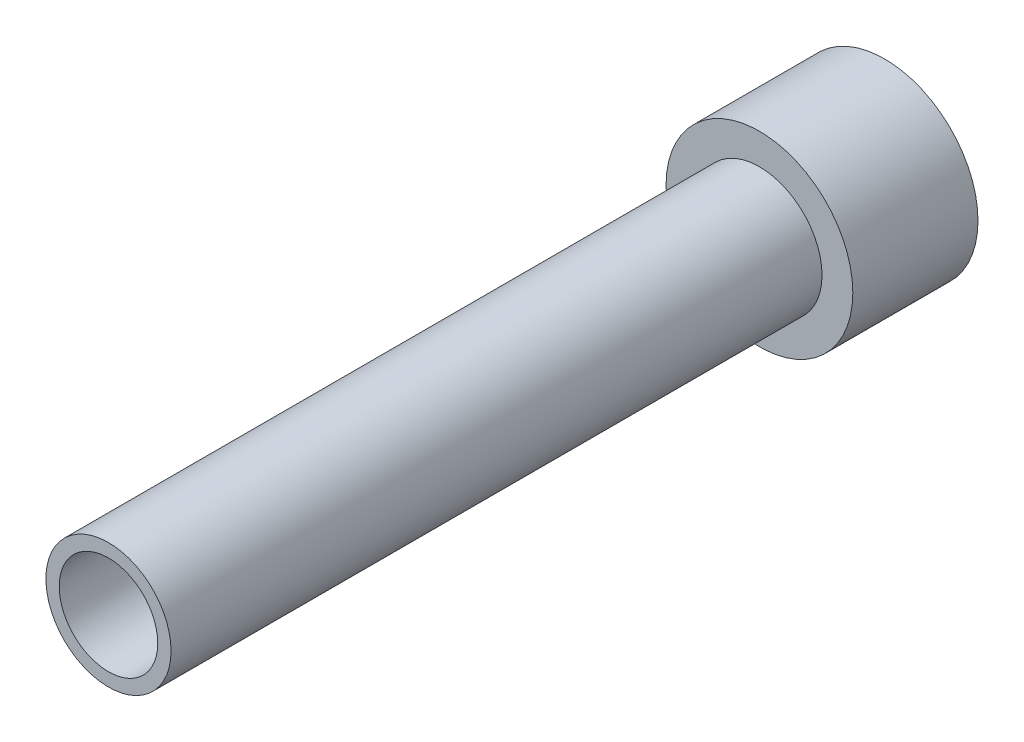
ISO-10303-21;
HEADER;
FILE_DESCRIPTION(('STEP AP214'),'2;1');
FILE_NAME('part.step','',(''),(''),'','','');
FILE_SCHEMA(('AUTOMOTIVE_DESIGN { 1 0 10303 214 1 1 1 1 }'));
ENDSEC;
DATA;
#1=APPLICATION_CONTEXT('core data for automotive mechanical design processes');
#2=APPLICATION_PROTOCOL_DEFINITION('international standard','automotive_design',2000,#1);
#3=PRODUCT_CONTEXT('',#1,'mechanical');
#4=PRODUCT('Part','Part','',(#3));
#5=PRODUCT_RELATED_PRODUCT_CATEGORY('part','',(#4));
#6=PRODUCT_DEFINITION_FORMATION('','',#4);
#7=PRODUCT_DEFINITION_CONTEXT('part definition',#1,'design');
#8=PRODUCT_DEFINITION('design','',#6,#7);
#9=PRODUCT_DEFINITION_SHAPE('','',#8);
#10=(LENGTH_UNIT() NAMED_UNIT(*) SI_UNIT(.MILLI.,.METRE.));
#11=(NAMED_UNIT(*) PLANE_ANGLE_UNIT() SI_UNIT($,.RADIAN.));
#12=(NAMED_UNIT(*) SI_UNIT($,.STERADIAN.) SOLID_ANGLE_UNIT());
#13=UNCERTAINTY_MEASURE_WITH_UNIT(LENGTH_MEASURE(1.E-05),#10,'distance_accuracy_value','');
#14=(GEOMETRIC_REPRESENTATION_CONTEXT(3) GLOBAL_UNCERTAINTY_ASSIGNED_CONTEXT((#13)) GLOBAL_UNIT_ASSIGNED_CONTEXT((#10,
#11,#12)) REPRESENTATION_CONTEXT('',''));
#15=CARTESIAN_POINT('',(0.,0.,0.));
#16=DIRECTION('',(0.,0.,1.));
#17=DIRECTION('',(1.,0.,0.));
#18=AXIS2_PLACEMENT_3D('',#15,#16,#17);
#19=CARTESIAN_POINT('',(0.,0.,6.35));
#20=DIRECTION('',(0.,0.,1.));
#21=DIRECTION('',(1.,0.,0.));
#22=AXIS2_PLACEMENT_3D('',#19,#20,#21);
#23=PLANE('',#22);
#24=CARTESIAN_POINT('',(0.,0.,6.35));
#25=DIRECTION('',(0.,0.,1.));
#26=DIRECTION('',(1.,0.,0.));
#27=AXIS2_PLACEMENT_3D('',#24,#25,#26);
#28=CIRCLE('',#27,4.7371);
#29=CARTESIAN_POINT('',(4.7371,0.,6.35));
#30=VERTEX_POINT('',#29);
#31=EDGE_CURVE('E56',#30,#30,#28,.T.);
#32=ORIENTED_EDGE('',*,*,#31,.T.);
#33=EDGE_LOOP('',(#32));
#34=FACE_BOUND('',#33,.T.);
#35=CARTESIAN_POINT('',(0.,0.,6.35));
#36=DIRECTION('',(0.,0.,1.));
#37=DIRECTION('',(1.,0.,0.));
#38=AXIS2_PLACEMENT_3D('',#35,#36,#37);
#39=CIRCLE('',#38,3.175);
#40=CARTESIAN_POINT('',(3.175,0.,6.35));
#41=VERTEX_POINT('',#40);
#42=EDGE_CURVE('E77',#41,#41,#39,.T.);
#43=ORIENTED_EDGE('',*,*,#42,.F.);
#44=EDGE_LOOP('',(#43));
#45=FACE_BOUND('',#44,.T.);
#46=ADVANCED_FACE('F43',(#34,#45),#23,.T.);
#47=CARTESIAN_POINT('',(0.,0.,0.));
#48=DIRECTION('',(0.,0.,1.));
#49=DIRECTION('',(1.,0.,0.));
#50=AXIS2_PLACEMENT_3D('',#47,#48,#49);
#51=PLANE('',#50);
#52=CARTESIAN_POINT('',(0.,0.,0.));
#53=DIRECTION('',(0.,0.,1.));
#54=DIRECTION('',(1.,0.,0.));
#55=AXIS2_PLACEMENT_3D('',#52,#53,#54);
#56=CIRCLE('',#55,4.7371);
#57=CARTESIAN_POINT('',(4.7371,0.,0.));
#58=VERTEX_POINT('',#57);
#59=EDGE_CURVE('E64',#58,#58,#56,.T.);
#60=ORIENTED_EDGE('',*,*,#59,.F.);
#61=EDGE_LOOP('',(#60));
#62=FACE_BOUND('',#61,.T.);
#63=CARTESIAN_POINT('',(0.,0.,0.));
#64=DIRECTION('',(0.,0.,1.));
#65=DIRECTION('',(1.,0.,0.));
#66=AXIS2_PLACEMENT_3D('',#63,#64,#65);
#67=CIRCLE('',#66,2.5);
#68=CARTESIAN_POINT('',(2.5,0.,0.));
#69=VERTEX_POINT('',#68);
#70=EDGE_CURVE('E72',#69,#69,#67,.T.);
#71=ORIENTED_EDGE('',*,*,#70,.T.);
#72=EDGE_LOOP('',(#71));
#73=FACE_BOUND('',#72,.T.);
#74=ADVANCED_FACE('F114',(#62,#73),#51,.F.);
#75=CARTESIAN_POINT('',(0.,0.,6.35));
#76=DIRECTION('',(0.,0.,-1.));
#77=DIRECTION('',(-1.,0.,0.));
#78=AXIS2_PLACEMENT_3D('',#75,#76,#77);
#79=CYLINDRICAL_SURFACE('',#78,4.7371);
#80=CARTESIAN_POINT('',(-4.7371,0.,4.32190817375387));
#81=CARTESIAN_POINT('',(-4.73709889125014,-0.0625405616559104,4.3219062625682));
#82=CARTESIAN_POINT('',(-4.73584904801133,-0.125103097961993,4.31670004141325));
#83=CARTESIAN_POINT('',(-4.73098412591691,-0.248441152194732,4.29604025940029));
#84=CARTESIAN_POINT('',(-4.7273675744181,-0.309215532852836,4.28058031826173));
#85=CARTESIAN_POINT('',(-4.71817054934764,-0.427177835338904,4.23993272667354));
#86=CARTESIAN_POINT('',(-4.71259231993318,-0.48436976777194,4.2147561888049));
#87=CARTESIAN_POINT('',(-4.70006902046337,-0.593717488100059,4.15542775500732));
#88=CARTESIAN_POINT('',(-4.69312393453729,-0.645873217508716,4.12127575486169));
#89=CARTESIAN_POINT('',(-4.67847685596836,-0.74465368885289,4.04428410113609));
#90=CARTESIAN_POINT('',(-4.67076403244581,-0.791169742943752,4.00130705213561));
#91=CARTESIAN_POINT('',(-4.65552433529257,-0.876406619304973,3.90817972887477));
#92=CARTESIAN_POINT('',(-4.64799748096374,-0.915126635376694,3.85802871366135));
#93=CARTESIAN_POINT('',(-4.63387370805021,-0.984171446729458,3.75114841794695));
#94=CARTESIAN_POINT('',(-4.62729059065517,-1.01437688910719,3.69434004687397));
#95=CARTESIAN_POINT('',(-4.6159567139578,-1.06476834656442,3.57626992773979));
#96=CARTESIAN_POINT('',(-4.61120569017989,-1.08495580793066,3.51500882398042));
#97=CARTESIAN_POINT('',(-4.60418488965656,-1.11437183828659,3.39096144564333));
#98=CARTESIAN_POINT('',(-4.60187117700749,-1.12379472662747,3.3282237937894));
#99=CARTESIAN_POINT('',(-4.59985529176796,-1.13201901840202,3.20201876937533));
#100=CARTESIAN_POINT('',(-4.60015273425018,-1.13082198738661,3.13855150574959));
#101=CARTESIAN_POINT('',(-4.60328594929033,-1.11799596278271,3.01416092876765));
#102=CARTESIAN_POINT('',(-4.60606592289982,-1.10659627804689,2.95321234866107));
#103=CARTESIAN_POINT('',(-4.61376231175299,-1.07405338910883,2.83411861621365));
#104=CARTESIAN_POINT('',(-4.61867886704646,-1.05290954618585,2.77597364792304));
#105=CARTESIAN_POINT('',(-4.6301470803956,-1.00127745241231,2.66351155499508));
#106=CARTESIAN_POINT('',(-4.6367135212722,-0.97070411803215,2.60923506334458));
#107=CARTESIAN_POINT('',(-4.65073302099635,-0.901140524252151,2.50649953061964));
#108=CARTESIAN_POINT('',(-4.65818622206764,-0.862148913861189,2.45804142524261));
#109=CARTESIAN_POINT('',(-4.673376106091,-0.775657909717885,2.36700172692014));
#110=CARTESIAN_POINT('',(-4.68111513324221,-0.72796442800202,2.32460470268608));
#111=CARTESIAN_POINT('',(-4.69583007336595,-0.626053383135011,2.24837737072195));
#112=CARTESIAN_POINT('',(-4.70280596692885,-0.571835654119117,2.21454728085539));
#113=CARTESIAN_POINT('',(-4.71523850331849,-0.458166287356143,2.15635487913558));
#114=CARTESIAN_POINT('',(-4.72069067599165,-0.398699909396376,2.13202034341384));
#115=CARTESIAN_POINT('',(-4.72942873988557,-0.276362064143312,2.09374294725469));
#116=CARTESIAN_POINT('',(-4.73271500757812,-0.2134911906673,2.07979828082301));
#117=CARTESIAN_POINT('',(-4.73669607814537,-0.0877089803765768,2.06297323156156));
#118=CARTESIAN_POINT('',(-4.73744980624507,-0.0248331193064465,2.05984121964908));
#119=CARTESIAN_POINT('',(-4.73644767710007,0.100543852963175,2.06404331404531));
#120=CARTESIAN_POINT('',(-4.73469202442044,0.163044994292788,2.0713765672241));
#121=CARTESIAN_POINT('',(-4.72890595117154,0.285039347135777,2.09609307745519));
#122=CARTESIAN_POINT('',(-4.72490616606975,0.344561549086645,2.11334106116024));
#123=CARTESIAN_POINT('',(-4.71508121828421,0.459866088700992,2.15724457186885));
#124=CARTESIAN_POINT('',(-4.70925588129728,0.515648068631488,2.18390099721844));
#125=CARTESIAN_POINT('',(-4.69628311030191,0.622904872294502,2.24636614564633));
#126=CARTESIAN_POINT('',(-4.68911547534309,0.674293591991877,2.28231842160243));
#127=CARTESIAN_POINT('',(-4.67428833638625,0.77039831306691,2.36216917770422));
#128=CARTESIAN_POINT('',(-4.66662875560164,0.815113269115239,2.40606890030153));
#129=CARTESIAN_POINT('',(-4.65147207266936,0.897622440279734,2.50173203565506));
#130=CARTESIAN_POINT('',(-4.64398235517519,0.935240930138576,2.55364841832939));
#131=CARTESIAN_POINT('',(-4.63020492486696,1.00122903786585,2.66320759759857));
#132=CARTESIAN_POINT('',(-4.62391715824705,1.02959906978568,2.72085013768383));
#133=CARTESIAN_POINT('',(-4.61332192146141,1.07607892046505,2.83991091149186));
#134=CARTESIAN_POINT('',(-4.60900281845386,1.09424916160824,2.9013044688614));
#135=CARTESIAN_POINT('',(-4.60281846884749,1.11998077809,3.02639224697933));
#136=CARTESIAN_POINT('',(-4.60095274180064,1.12754423059008,3.09008601476333));
#137=CARTESIAN_POINT('',(-4.5999206541659,1.13174646387406,3.21618455015959));
#138=CARTESIAN_POINT('',(-4.60068512020545,1.12866518930144,3.27857957899529));
#139=CARTESIAN_POINT('',(-4.60466867065687,1.11230050379976,3.4019331229333));
#140=CARTESIAN_POINT('',(-4.60788771396334,1.09901726371713,3.46289166207404));
#141=CARTESIAN_POINT('',(-4.61638093955697,1.06277215505669,3.58136852099791));
#142=CARTESIAN_POINT('',(-4.62164490577122,1.03985835316509,3.63890232763256));
#143=CARTESIAN_POINT('',(-4.63363717711593,0.98504144909959,3.74934792532066));
#144=CARTESIAN_POINT('',(-4.64036566691121,0.953137213153555,3.80225913232079));
#145=CARTESIAN_POINT('',(-4.65472966573764,0.880348260373164,3.90332083129816));
#146=CARTESIAN_POINT('',(-4.66238299870828,0.839267267002926,3.9513274487352));
#147=CARTESIAN_POINT('',(-4.67762312346263,0.749679326170295,4.03985689730677));
#148=CARTESIAN_POINT('',(-4.68520989922044,0.701170639459963,4.08037797073113));
#149=CARTESIAN_POINT('',(-4.69960749770395,0.597162393660711,4.1534179412152));
#150=CARTESIAN_POINT('',(-4.70640386964326,0.541562901367534,4.18579757845473));
#151=CARTESIAN_POINT('',(-4.71830558515459,0.425555164288989,4.24069922342863));
#152=CARTESIAN_POINT('',(-4.72341221939894,0.365150633687359,4.26322875921221));
#153=CARTESIAN_POINT('',(-4.73054412719306,0.253988301769169,4.29418880337964));
#154=CARTESIAN_POINT('',(-4.73298633544027,0.203789312403313,4.30456212964035));
#155=CARTESIAN_POINT('',(-4.73626467580094,0.102398417916854,4.31842238306816));
#156=CARTESIAN_POINT('',(-4.73710090781537,0.0512065747575895,4.32190973858266));
#157=CARTESIAN_POINT('',(-4.7371,0.,4.32190817375387));
#158=B_SPLINE_CURVE_WITH_KNOTS('',3,(#80,#81,#82,#83,#84,#85,#86,#87,#88,#89,#90,#91,#92,#93,
#94,#95,#96,#97,#98,#99,#100,#101,#102,#103,#104,#105,#106,#107,#108,#109,#110,#111,#112,#113,
#114,#115,#116,#117,#118,#119,#120,#121,#122,#123,#124,#125,#126,#127,#128,#129,#130,#131,#132,
#133,#134,#135,#136,#137,#138,#139,#140,#141,#142,#143,#144,#145,#146,#147,#148,#149,#150,#151,
#152,#153,#154,#155,#156,#157),.UNSPECIFIED.,.T.,.F.,(4,2,2,2,2,2,2,2,2,2,2,2,2,2,2,2,2,2,2,2,2,
2,2,2,2,2,2,2,2,2,2,2,2,2,2,2,2,2,4),(0.,0.187434115816462,0.374984970299656,0.562321961085937,
0.749661127192337,0.940174489277266,1.13070754249454,1.32379180711334,1.51684818821859,
1.70636158326492,1.89584704138151,2.08117780213822,2.26652071288655,2.4535875045856,
2.64068433969037,2.83262387841438,3.02456829781365,3.21707005245938,3.40953833813491,
3.59749620355073,3.78543874748961,3.97087594838264,4.15633086016397,4.34484123148993,
4.53338109877864,4.7261075564406,4.91882538459682,5.11038918989577,5.30191547539783,
5.48844359763173,5.67496859625488,5.86057349042886,6.04620180148158,6.23626331947123,
6.42636940998561,6.61953460122421,6.81255190465728,6.96602759960006,7.11949374716177),.UNSPECIFIED.);
#159=CARTESIAN_POINT('',(-4.7371,0.,4.32190817375387));
#160=VERTEX_POINT('',#159);
#161=EDGE_CURVE('E10',#160,#160,#158,.T.);
#162=ORIENTED_EDGE('',*,*,#161,.T.);
#163=EDGE_LOOP('',(#162));
#164=FACE_BOUND('',#163,.T.);
#165=ORIENTED_EDGE('',*,*,#31,.F.);
#166=EDGE_LOOP('',(#165));
#167=FACE_BOUND('',#166,.T.);
#168=ORIENTED_EDGE('',*,*,#59,.T.);
#169=EDGE_LOOP('',(#168));
#170=FACE_BOUND('',#169,.T.);
#171=ADVANCED_FACE('F45',(#164,#167,#170),#79,.T.);
#172=CARTESIAN_POINT('',(0.,0.,6.35));
#173=DIRECTION('',(0.,0.,-1.));
#174=DIRECTION('',(-1.,0.,0.));
#175=AXIS2_PLACEMENT_3D('',#172,#173,#174);
#176=CYLINDRICAL_SURFACE('',#175,2.5);
#177=CARTESIAN_POINT('',(-2.5,0.,4.32190817375387));
#178=CARTESIAN_POINT('',(-2.49999753532052,-0.0600822781699421,4.32190519010651));
#179=CARTESIAN_POINT('',(-2.49780998569268,-0.120255579793321,4.31708934999698));
#180=CARTESIAN_POINT('',(-2.48927659139313,-0.238864936200406,4.29801966384633));
#181=CARTESIAN_POINT('',(-2.48292101568391,-0.297296590206035,4.28374373062889));
#182=CARTESIAN_POINT('',(-2.46672504100596,-0.410519737980339,4.24640262474459));
#183=CARTESIAN_POINT('',(-2.45689724977841,-0.465323560820436,4.22336922800749));
#184=CARTESIAN_POINT('',(-2.43469105852836,-0.570226447848531,4.16931185872671));
#185=CARTESIAN_POINT('',(-2.42231318685542,-0.620326483486105,4.13828954107022));
#186=CARTESIAN_POINT('',(-2.39542952734409,-0.717343781540012,4.06727692519043));
#187=CARTESIAN_POINT('',(-2.38084643173633,-0.763958808348631,4.02690331522822));
#188=CARTESIAN_POINT('',(-2.35149528944333,-0.85002441305893,3.93914926029241));
#189=CARTESIAN_POINT('',(-2.33672713461405,-0.889470570876482,3.89176452493358));
#190=CARTESIAN_POINT('',(-2.30766976105589,-0.962442756535044,3.7878865205287));
#191=CARTESIAN_POINT('',(-2.29346302025365,-0.995468844501713,3.73101645276735));
#192=CARTESIAN_POINT('',(-2.26839208577814,-1.05135258954231,3.61180105394154));
#193=CARTESIAN_POINT('',(-2.25752587849092,-1.07421637599037,3.54945905051372));
#194=CARTESIAN_POINT('',(-2.24121806115519,-1.10782476642698,3.42453796049981));
#195=CARTESIAN_POINT('',(-2.2355162032548,-1.11915487795904,3.36215183942219));
#196=CARTESIAN_POINT('',(-2.22945167708961,-1.1311921664553,3.2361239151627));
#197=CARTESIAN_POINT('',(-2.22908524805582,-1.13190682591099,3.17248302811167));
#198=CARTESIAN_POINT('',(-2.23351683738999,-1.12312848632354,3.05210850312616));
#199=CARTESIAN_POINT('',(-2.23783618785691,-1.11458166981261,2.9952844200852));
#200=CARTESIAN_POINT('',(-2.25033149246957,-1.08913130633431,2.88398601822338));
#201=CARTESIAN_POINT('',(-2.25850835374474,-1.07222579369702,2.82951225539253));
#202=CARTESIAN_POINT('',(-2.27798715558767,-1.03020341851955,2.7229781944985));
#203=CARTESIAN_POINT('',(-2.28935580707384,-1.00490890992585,2.67100072538614));
#204=CARTESIAN_POINT('',(-2.31392853665228,-0.94695513490924,2.57180380481031));
#205=CARTESIAN_POINT('',(-2.3271333978298,-0.914292722591362,2.52458639826138));
#206=CARTESIAN_POINT('',(-2.3555119211023,-0.83866116783685,2.43122030766581));
#207=CARTESIAN_POINT('',(-2.37074960054508,-0.794983554799028,2.3856631791026));
#208=CARTESIAN_POINT('',(-2.40036815772633,-0.700488055365266,2.3023018525865));
#209=CARTESIAN_POINT('',(-2.41474875734216,-0.649667868974444,2.26450016166099));
#210=CARTESIAN_POINT('',(-2.441595329966,-0.540258539490567,2.19663624599656));
#211=CARTESIAN_POINT('',(-2.45398660301872,-0.481474906305864,2.16685575397384));
#212=CARTESIAN_POINT('',(-2.4748626594719,-0.359027896950457,2.1178212427441));
#213=CARTESIAN_POINT('',(-2.48334999142515,-0.295367736011091,2.09856035463438));
#214=CARTESIAN_POINT('',(-2.49495947814047,-0.169881134337021,2.07244478053609));
#215=CARTESIAN_POINT('',(-2.49842301024102,-0.10825106057275,2.06479882868542));
#216=CARTESIAN_POINT('',(-2.50071674189136,0.0155054827584754,2.05972085475632));
#217=CARTESIAN_POINT('',(-2.49954858951989,0.0776317679084563,2.06228519957925));
#218=CARTESIAN_POINT('',(-2.49292468795018,0.196637407064394,2.07702778069765));
#219=CARTESIAN_POINT('',(-2.48773299827167,0.25360660526838,2.08861412955853));
#220=CARTESIAN_POINT('',(-2.47388829633388,0.364708953054158,2.12020615681207));
#221=CARTESIAN_POINT('',(-2.46523486864258,0.418841761367811,2.14021284571758));
#222=CARTESIAN_POINT('',(-2.44494100839571,0.524649476351218,2.18870559194826));
#223=CARTESIAN_POINT('',(-2.43321610703453,0.576195720898968,2.21743583748114));
#224=CARTESIAN_POINT('',(-2.40798300337697,0.673920744470044,2.28229406571106));
#225=CARTESIAN_POINT('',(-2.39447402094728,0.72009715869568,2.31842528849773));
#226=CARTESIAN_POINT('',(-2.365711336932,0.809820978251054,2.40055360346166));
#227=CARTESIAN_POINT('',(-2.35040593918311,0.852830990637241,2.44712105848629));
#228=CARTESIAN_POINT('',(-2.32070956290476,0.930615104407229,2.54698320310193));
#229=CARTESIAN_POINT('',(-2.30631894715077,0.965385953108912,2.60028053684914));
#230=CARTESIAN_POINT('',(-2.27978800760565,1.0265035925915,2.71396852220422));
#231=CARTESIAN_POINT('',(-2.26771717388814,1.05260357478991,2.77450936616503));
#232=CARTESIAN_POINT('',(-2.24805111549491,1.09398365543882,2.899851817901));
#233=CARTESIAN_POINT('',(-2.24045131482283,1.10927481970081,2.96464899362599));
#234=CARTESIAN_POINT('',(-2.23137234406808,1.12741784093358,3.09061722594103));
#235=CARTESIAN_POINT('',(-2.22941953274959,1.13123346685629,3.1516154203954));
#236=CARTESIAN_POINT('',(-2.23056169824744,1.12898055369407,3.27337343592874));
#237=CARTESIAN_POINT('',(-2.23365549278361,1.12291432965375,3.33413330949713));
#238=CARTESIAN_POINT('',(-2.24407859716409,1.10192249763591,3.44961768807222));
#239=CARTESIAN_POINT('',(-2.25112244914719,1.08759230069689,3.50447893194039));
#240=CARTESIAN_POINT('',(-2.26838018341276,1.05112132051272,3.61100540452354));
#241=CARTESIAN_POINT('',(-2.27859499046872,1.02897825847537,3.66266969560457));
#242=CARTESIAN_POINT('',(-2.3018625679474,0.975868743486251,3.76501499748917));
#243=CARTESIAN_POINT('',(-2.31505655938752,0.944422675042858,3.81541426710497));
#244=CARTESIAN_POINT('',(-2.34247247324534,0.874209588312668,3.91051912175575));
#245=CARTESIAN_POINT('',(-2.35669484178566,0.835439380820094,3.95522221220731));
#246=CARTESIAN_POINT('',(-2.38613100197327,0.747475338300104,4.04190938965517));
#247=CARTESIAN_POINT('',(-2.40131593750279,0.697651312674878,4.08326705776534));
#248=CARTESIAN_POINT('',(-2.42970215828352,0.591249054874763,4.1571106183538));
#249=CARTESIAN_POINT('',(-2.44290252702554,0.534667723564207,4.18959241742027));
#250=CARTESIAN_POINT('',(-2.46574755679697,0.416728451415863,4.24427212982793));
#251=CARTESIAN_POINT('',(-2.47542460250943,0.355420635337768,4.26656421425028));
#252=CARTESIAN_POINT('',(-2.49024775142017,0.229471002212837,4.30027624327833));
#253=CARTESIAN_POINT('',(-2.49540756097344,0.164839905116672,4.31172908532248));
#254=CARTESIAN_POINT('',(-2.49867280408139,0.0831472137592139,4.31896957281664));
#255=CARTESIAN_POINT('',(-2.49916960292581,0.0665428536369052,4.32007046599491));
#256=CARTESIAN_POINT('',(-2.49983354479593,0.0332946596830814,4.32154018520103));
#257=CARTESIAN_POINT('',(-2.50000068304579,0.0166508252831943,4.32190900062316));
#258=CARTESIAN_POINT('',(-2.5,0.,4.32190817375387));
#259=B_SPLINE_CURVE_WITH_KNOTS('',3,(#177,#178,#179,#180,#181,#182,#183,#184,#185,#186,#187,
#188,#189,#190,#191,#192,#193,#194,#195,#196,#197,#198,#199,#200,#201,#202,#203,#204,#205,#206,
#207,#208,#209,#210,#211,#212,#213,#214,#215,#216,#217,#218,#219,#220,#221,#222,#223,#224,#225,
#226,#227,#228,#229,#230,#231,#232,#233,#234,#235,#236,#237,#238,#239,#240,#241,#242,#243,#244,
#245,#246,#247,#248,#249,#250,#251,#252,#253,#254,#255,#256,#257,#258),.UNSPECIFIED.,.T.,.F.,(4,
2,2,2,2,2,2,2,2,2,2,2,2,2,2,2,2,2,2,2,2,2,2,2,2,2,2,2,2,2,2,2,2,2,2,2,2,2,2,2,4),(0.,
0.18017852828696,0.360779221863851,0.540730775548947,0.720645082613015,0.909941937909637,
1.0993551142356,1.30018149963434,1.50088659203675,1.69080053665015,1.88058061066137,
2.05265365697005,2.22476718803771,2.40078676336934,2.57688163701786,2.77079443678603,
2.96476982249504,3.1648636881861,3.36482674348611,3.55043670236245,3.73598062211844,
3.91028304037042,4.08460638237139,4.26434709700547,4.44416666953937,4.63893005127565,
4.83377019466564,5.03375752759587,5.23353982053461,5.41599643659577,5.59841031425673,
5.7690822652223,5.93980403758471,6.1216126623015,6.30350063657832,6.50208743663038,
6.70076566782372,6.89756866886194,7.0937724328905,7.14370525540412,7.19363880129603),.UNSPECIFIED.);
#260=CARTESIAN_POINT('',(-2.5,0.,4.32190817375387));
#261=VERTEX_POINT('',#260);
#262=EDGE_CURVE('E86',#261,#261,#259,.T.);
#263=ORIENTED_EDGE('',*,*,#262,.F.);
#264=EDGE_LOOP('',(#263));
#265=FACE_BOUND('',#264,.T.);
#266=ORIENTED_EDGE('',*,*,#70,.F.);
#267=EDGE_LOOP('',(#266));
#268=FACE_BOUND('',#267,.T.);
#269=CARTESIAN_POINT('',(0.,0.,39.37));
#270=DIRECTION('',(0.,0.,1.));
#271=DIRECTION('',(1.,0.,0.));
#272=AXIS2_PLACEMENT_3D('',#269,#270,#271);
#273=CIRCLE('',#272,2.5);
#274=CARTESIAN_POINT('',(2.5,0.,39.37));
#275=VERTEX_POINT('',#274);
#276=EDGE_CURVE('E80',#275,#275,#273,.T.);
#277=ORIENTED_EDGE('',*,*,#276,.T.);
#278=EDGE_LOOP('',(#277));
#279=FACE_BOUND('',#278,.T.);
#280=ADVANCED_FACE('F93',(#265,#268,#279),#176,.F.);
#281=CARTESIAN_POINT('',(0.,0.,39.37));
#282=DIRECTION('',(0.,0.,1.));
#283=DIRECTION('',(1.,0.,0.));
#284=AXIS2_PLACEMENT_3D('',#281,#282,#283);
#285=PLANE('',#284);
#286=CARTESIAN_POINT('',(0.,0.,39.37));
#287=DIRECTION('',(0.,0.,1.));
#288=DIRECTION('',(1.,0.,0.));
#289=AXIS2_PLACEMENT_3D('',#286,#287,#288);
#290=CIRCLE('',#289,3.175);
#291=CARTESIAN_POINT('',(3.175,0.,39.37));
#292=VERTEX_POINT('',#291);
#293=EDGE_CURVE('E76',#292,#292,#290,.T.);
#294=ORIENTED_EDGE('',*,*,#293,.T.);
#295=EDGE_LOOP('',(#294));
#296=FACE_BOUND('',#295,.T.);
#297=ORIENTED_EDGE('',*,*,#276,.F.);
#298=EDGE_LOOP('',(#297));
#299=FACE_BOUND('',#298,.T.);
#300=ADVANCED_FACE('F103',(#296,#299),#285,.T.);
#301=CARTESIAN_POINT('',(0.,0.,39.37));
#302=DIRECTION('',(0.,0.,-1.));
#303=DIRECTION('',(-1.,0.,0.));
#304=AXIS2_PLACEMENT_3D('',#301,#302,#303);
#305=CYLINDRICAL_SURFACE('',#304,3.175);
#306=ORIENTED_EDGE('',*,*,#293,.F.);
#307=EDGE_LOOP('',(#306));
#308=FACE_BOUND('',#307,.T.);
#309=ORIENTED_EDGE('',*,*,#42,.T.);
#310=EDGE_LOOP('',(#309));
#311=FACE_BOUND('',#310,.T.);
#312=ADVANCED_FACE('F101',(#308,#311),#305,.T.);
#313=CARTESIAN_POINT('',(-4.7371,0.,3.19160817375387));
#314=DIRECTION('',(-1.,0.,0.));
#315=DIRECTION('',(0.,0.,1.));
#316=AXIS2_PLACEMENT_3D('',#313,#314,#315);
#317=CYLINDRICAL_SURFACE('',#316,1.13029999999999);
#318=ORIENTED_EDGE('',*,*,#262,.T.);
#319=EDGE_LOOP('',(#318));
#320=FACE_BOUND('',#319,.T.);
#321=ORIENTED_EDGE('',*,*,#161,.F.);
#322=EDGE_LOOP('',(#321));
#323=FACE_BOUND('',#322,.T.);
#324=ADVANCED_FACE('F97',(#320,#323),#317,.F.);
#325=CLOSED_SHELL('',(#46,#74,#171,#280,#300,#312,#324));
#326=MANIFOLD_SOLID_BREP('B2',#325);
#327=ADVANCED_BREP_SHAPE_REPRESENTATION('',(#18,#326),#14);
#328=SHAPE_DEFINITION_REPRESENTATION(#9,#327);
ENDSEC;
END-ISO-10303-21;
